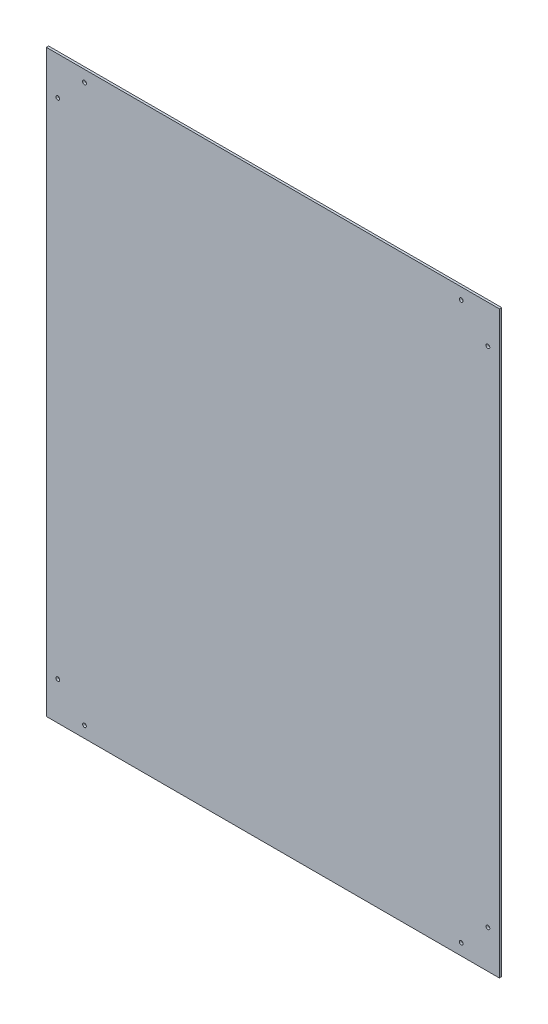
ISO-10303-21;
HEADER;
FILE_DESCRIPTION(('STEP AP214'),'2;1');
FILE_NAME('part.step','',(''),(''),'','','');
FILE_SCHEMA(('AUTOMOTIVE_DESIGN { 1 0 10303 214 1 1 1 1 }'));
ENDSEC;
DATA;
#1=APPLICATION_CONTEXT('core data for automotive mechanical design processes');
#2=APPLICATION_PROTOCOL_DEFINITION('international standard','automotive_design',2000,#1);
#3=PRODUCT_CONTEXT('',#1,'mechanical');
#4=PRODUCT('Part','Part','',(#3));
#5=PRODUCT_RELATED_PRODUCT_CATEGORY('part','',(#4));
#6=PRODUCT_DEFINITION_FORMATION('','',#4);
#7=PRODUCT_DEFINITION_CONTEXT('part definition',#1,'design');
#8=PRODUCT_DEFINITION('design','',#6,#7);
#9=PRODUCT_DEFINITION_SHAPE('','',#8);
#10=(LENGTH_UNIT() NAMED_UNIT(*) SI_UNIT(.MILLI.,.METRE.));
#11=(NAMED_UNIT(*) PLANE_ANGLE_UNIT() SI_UNIT($,.RADIAN.));
#12=(NAMED_UNIT(*) SI_UNIT($,.STERADIAN.) SOLID_ANGLE_UNIT());
#13=UNCERTAINTY_MEASURE_WITH_UNIT(LENGTH_MEASURE(1.E-05),#10,'distance_accuracy_value','');
#14=(GEOMETRIC_REPRESENTATION_CONTEXT(3) GLOBAL_UNCERTAINTY_ASSIGNED_CONTEXT((#13)) GLOBAL_UNIT_ASSIGNED_CONTEXT((#10,
#11,#12)) REPRESENTATION_CONTEXT('',''));
#15=CARTESIAN_POINT('',(0.,0.,0.));
#16=DIRECTION('',(0.,0.,1.));
#17=DIRECTION('',(1.,0.,0.));
#18=AXIS2_PLACEMENT_3D('',#15,#16,#17);
#19=CARTESIAN_POINT('',(0.,0.,3.));
#20=DIRECTION('',(1.,0.,0.));
#21=DIRECTION('',(0.,0.,-1.));
#22=AXIS2_PLACEMENT_3D('',#19,#20,#21);
#23=PLANE('',#22);
#24=DIRECTION('',(0.,-1.,0.));
#25=VECTOR('',#24,1.);
#26=CARTESIAN_POINT('',(0.,0.,0.));
#27=LINE('',#26,#25);
#28=CARTESIAN_POINT('',(0.,760.,0.));
#29=VERTEX_POINT('',#28);
#30=CARTESIAN_POINT('',(0.,0.,0.));
#31=VERTEX_POINT('',#30);
#32=EDGE_CURVE('E96',#29,#31,#27,.T.);
#33=ORIENTED_EDGE('',*,*,#32,.T.);
#34=DIRECTION('',(0.,0.,-1.));
#35=VECTOR('',#34,1.);
#36=CARTESIAN_POINT('',(0.,0.,3.));
#37=LINE('',#36,#35);
#38=CARTESIAN_POINT('',(0.,0.,3.));
#39=VERTEX_POINT('',#38);
#40=EDGE_CURVE('E11',#39,#31,#37,.T.);
#41=ORIENTED_EDGE('',*,*,#40,.F.);
#42=DIRECTION('',(0.,-1.,0.));
#43=VECTOR('',#42,1.);
#44=CARTESIAN_POINT('',(0.,0.,3.));
#45=LINE('',#44,#43);
#46=CARTESIAN_POINT('',(0.,760.,3.));
#47=VERTEX_POINT('',#46);
#48=EDGE_CURVE('E84',#47,#39,#45,.T.);
#49=ORIENTED_EDGE('',*,*,#48,.F.);
#50=DIRECTION('',(0.,0.,-1.));
#51=VECTOR('',#50,1.);
#52=CARTESIAN_POINT('',(0.,760.,3.));
#53=LINE('',#52,#51);
#54=EDGE_CURVE('E92',#47,#29,#53,.T.);
#55=ORIENTED_EDGE('',*,*,#54,.T.);
#56=EDGE_LOOP('',(#33,#41,#49,#55));
#57=FACE_BOUND('',#56,.T.);
#58=ADVANCED_FACE('F33',(#57),#23,.F.);
#59=CARTESIAN_POINT('',(0.,0.,3.));
#60=DIRECTION('',(0.,1.,0.));
#61=DIRECTION('',(0.,0.,1.));
#62=AXIS2_PLACEMENT_3D('',#59,#60,#61);
#63=PLANE('',#62);
#64=DIRECTION('',(1.,0.,0.));
#65=VECTOR('',#64,1.);
#66=CARTESIAN_POINT('',(0.,0.,0.));
#67=LINE('',#66,#65);
#68=CARTESIAN_POINT('',(594.,0.,0.));
#69=VERTEX_POINT('',#68);
#70=EDGE_CURVE('E88',#31,#69,#67,.T.);
#71=ORIENTED_EDGE('',*,*,#70,.T.);
#72=DIRECTION('',(0.,0.,-1.));
#73=VECTOR('',#72,1.);
#74=CARTESIAN_POINT('',(594.,0.,3.));
#75=LINE('',#74,#73);
#76=CARTESIAN_POINT('',(594.,0.,3.));
#77=VERTEX_POINT('',#76);
#78=EDGE_CURVE('E41',#77,#69,#75,.T.);
#79=ORIENTED_EDGE('',*,*,#78,.F.);
#80=DIRECTION('',(1.,0.,0.));
#81=VECTOR('',#80,1.);
#82=CARTESIAN_POINT('',(0.,0.,3.));
#83=LINE('',#82,#81);
#84=EDGE_CURVE('E79',#39,#77,#83,.T.);
#85=ORIENTED_EDGE('',*,*,#84,.F.);
#86=ORIENTED_EDGE('',*,*,#40,.T.);
#87=EDGE_LOOP('',(#71,#79,#85,#86));
#88=FACE_BOUND('',#87,.T.);
#89=ADVANCED_FACE('F87',(#88),#63,.F.);
#90=CARTESIAN_POINT('',(594.,0.,3.));
#91=DIRECTION('',(-1.,0.,0.));
#92=DIRECTION('',(0.,0.,1.));
#93=AXIS2_PLACEMENT_3D('',#90,#91,#92);
#94=PLANE('',#93);
#95=DIRECTION('',(0.,1.,0.));
#96=VECTOR('',#95,1.);
#97=CARTESIAN_POINT('',(594.,0.,0.));
#98=LINE('',#97,#96);
#99=CARTESIAN_POINT('',(594.,760.,0.));
#100=VERTEX_POINT('',#99);
#101=EDGE_CURVE('E66',#69,#100,#98,.T.);
#102=ORIENTED_EDGE('',*,*,#101,.T.);
#103=DIRECTION('',(0.,0.,-1.));
#104=VECTOR('',#103,1.);
#105=CARTESIAN_POINT('',(594.,760.,3.));
#106=LINE('',#105,#104);
#107=CARTESIAN_POINT('',(594.,760.,3.));
#108=VERTEX_POINT('',#107);
#109=EDGE_CURVE('E89',#108,#100,#106,.T.);
#110=ORIENTED_EDGE('',*,*,#109,.F.);
#111=DIRECTION('',(0.,1.,0.));
#112=VECTOR('',#111,1.);
#113=CARTESIAN_POINT('',(594.,0.,3.));
#114=LINE('',#113,#112);
#115=EDGE_CURVE('E82',#77,#108,#114,.T.);
#116=ORIENTED_EDGE('',*,*,#115,.F.);
#117=ORIENTED_EDGE('',*,*,#78,.T.);
#118=EDGE_LOOP('',(#102,#110,#116,#117));
#119=FACE_BOUND('',#118,.T.);
#120=ADVANCED_FACE('F90',(#119),#94,.F.);
#121=CARTESIAN_POINT('',(0.,760.,3.));
#122=DIRECTION('',(0.,-1.,0.));
#123=DIRECTION('',(0.,0.,-1.));
#124=AXIS2_PLACEMENT_3D('',#121,#122,#123);
#125=PLANE('',#124);
#126=DIRECTION('',(-1.,0.,0.));
#127=VECTOR('',#126,1.);
#128=CARTESIAN_POINT('',(0.,760.,0.));
#129=LINE('',#128,#127);
#130=EDGE_CURVE('E72',#100,#29,#129,.T.);
#131=ORIENTED_EDGE('',*,*,#130,.T.);
#132=ORIENTED_EDGE('',*,*,#54,.F.);
#133=DIRECTION('',(-1.,0.,0.));
#134=VECTOR('',#133,1.);
#135=CARTESIAN_POINT('',(0.,760.,3.));
#136=LINE('',#135,#134);
#137=EDGE_CURVE('E49',#108,#47,#136,.T.);
#138=ORIENTED_EDGE('',*,*,#137,.F.);
#139=ORIENTED_EDGE('',*,*,#109,.T.);
#140=EDGE_LOOP('',(#131,#132,#138,#139));
#141=FACE_BOUND('',#140,.T.);
#142=ADVANCED_FACE('F104',(#141),#125,.F.);
#143=CARTESIAN_POINT('',(0.,760.,3.));
#144=DIRECTION('',(0.,0.,-1.));
#145=DIRECTION('',(-1.,0.,0.));
#146=AXIS2_PLACEMENT_3D('',#143,#144,#145);
#147=PLANE('',#146);
#148=CARTESIAN_POINT('',(544.,745.,3.));
#149=DIRECTION('',(0.,0.,1.));
#150=DIRECTION('',(-1.,0.,0.));
#151=AXIS2_PLACEMENT_3D('',#148,#149,#150);
#152=CIRCLE('',#151,2.50000000000013);
#153=CARTESIAN_POINT('',(541.5,745.,3.));
#154=VERTEX_POINT('',#153);
#155=EDGE_CURVE('E152',#154,#154,#152,.T.);
#156=ORIENTED_EDGE('',*,*,#155,.F.);
#157=EDGE_LOOP('',(#156));
#158=FACE_BOUND('',#157,.T.);
#159=CARTESIAN_POINT('',(579.,710.,3.));
#160=DIRECTION('',(0.,0.,1.));
#161=DIRECTION('',(-1.,0.,0.));
#162=AXIS2_PLACEMENT_3D('',#159,#160,#161);
#163=CIRCLE('',#162,2.49999999999992);
#164=CARTESIAN_POINT('',(576.5,710.,3.));
#165=VERTEX_POINT('',#164);
#166=EDGE_CURVE('E146',#165,#165,#163,.T.);
#167=ORIENTED_EDGE('',*,*,#166,.F.);
#168=EDGE_LOOP('',(#167));
#169=FACE_BOUND('',#168,.T.);
#170=CARTESIAN_POINT('',(579.,50.0000000000001,3.));
#171=DIRECTION('',(0.,0.,1.));
#172=DIRECTION('',(-1.,0.,0.));
#173=AXIS2_PLACEMENT_3D('',#170,#171,#172);
#174=CIRCLE('',#173,2.49999999999991);
#175=CARTESIAN_POINT('',(576.5,50.0000000000001,3.));
#176=VERTEX_POINT('',#175);
#177=EDGE_CURVE('E140',#176,#176,#174,.T.);
#178=ORIENTED_EDGE('',*,*,#177,.F.);
#179=EDGE_LOOP('',(#178));
#180=FACE_BOUND('',#179,.T.);
#181=CARTESIAN_POINT('',(544.,15.0000000000001,3.));
#182=DIRECTION('',(0.,0.,1.));
#183=DIRECTION('',(-1.,0.,0.));
#184=AXIS2_PLACEMENT_3D('',#181,#182,#183);
#185=CIRCLE('',#184,2.50000000000014);
#186=CARTESIAN_POINT('',(541.5,15.0000000000001,3.));
#187=VERTEX_POINT('',#186);
#188=EDGE_CURVE('E134',#187,#187,#185,.T.);
#189=ORIENTED_EDGE('',*,*,#188,.F.);
#190=EDGE_LOOP('',(#189));
#191=FACE_BOUND('',#190,.T.);
#192=CARTESIAN_POINT('',(50.,15.,3.));
#193=DIRECTION('',(0.,0.,1.));
#194=DIRECTION('',(1.,0.,0.));
#195=AXIS2_PLACEMENT_3D('',#192,#193,#194);
#196=CIRCLE('',#195,2.5);
#197=CARTESIAN_POINT('',(52.5,15.,3.));
#198=VERTEX_POINT('',#197);
#199=EDGE_CURVE('E128',#198,#198,#196,.T.);
#200=ORIENTED_EDGE('',*,*,#199,.F.);
#201=EDGE_LOOP('',(#200));
#202=FACE_BOUND('',#201,.T.);
#203=CARTESIAN_POINT('',(15.,50.,3.));
#204=DIRECTION('',(0.,0.,1.));
#205=DIRECTION('',(1.,0.,0.));
#206=AXIS2_PLACEMENT_3D('',#203,#204,#205);
#207=CIRCLE('',#206,2.5);
#208=CARTESIAN_POINT('',(17.5,50.,3.));
#209=VERTEX_POINT('',#208);
#210=EDGE_CURVE('E122',#209,#209,#207,.T.);
#211=ORIENTED_EDGE('',*,*,#210,.F.);
#212=EDGE_LOOP('',(#211));
#213=FACE_BOUND('',#212,.T.);
#214=CARTESIAN_POINT('',(15.,710.,3.));
#215=DIRECTION('',(0.,0.,1.));
#216=DIRECTION('',(1.,0.,0.));
#217=AXIS2_PLACEMENT_3D('',#214,#215,#216);
#218=CIRCLE('',#217,2.5);
#219=CARTESIAN_POINT('',(17.5,710.,3.));
#220=VERTEX_POINT('',#219);
#221=EDGE_CURVE('E116',#220,#220,#218,.T.);
#222=ORIENTED_EDGE('',*,*,#221,.F.);
#223=EDGE_LOOP('',(#222));
#224=FACE_BOUND('',#223,.T.);
#225=CARTESIAN_POINT('',(50.,745.,3.));
#226=DIRECTION('',(0.,0.,1.));
#227=DIRECTION('',(1.,0.,0.));
#228=AXIS2_PLACEMENT_3D('',#225,#226,#227);
#229=CIRCLE('',#228,2.5);
#230=CARTESIAN_POINT('',(52.5,745.,3.));
#231=VERTEX_POINT('',#230);
#232=EDGE_CURVE('E110',#231,#231,#229,.T.);
#233=ORIENTED_EDGE('',*,*,#232,.F.);
#234=EDGE_LOOP('',(#233));
#235=FACE_BOUND('',#234,.T.);
#236=ORIENTED_EDGE('',*,*,#48,.T.);
#237=ORIENTED_EDGE('',*,*,#84,.T.);
#238=ORIENTED_EDGE('',*,*,#115,.T.);
#239=ORIENTED_EDGE('',*,*,#137,.T.);
#240=EDGE_LOOP('',(#236,#237,#238,#239));
#241=FACE_BOUND('',#240,.T.);
#242=ADVANCED_FACE('F80',(#158,#169,#180,#191,#202,#213,#224,#235,#241),#147,.F.);
#243=CARTESIAN_POINT('',(0.,760.,0.));
#244=DIRECTION('',(0.,0.,-1.));
#245=DIRECTION('',(-1.,0.,0.));
#246=AXIS2_PLACEMENT_3D('',#243,#244,#245);
#247=PLANE('',#246);
#248=CARTESIAN_POINT('',(544.,745.,0.));
#249=DIRECTION('',(0.,0.,1.));
#250=DIRECTION('',(-1.,0.,0.));
#251=AXIS2_PLACEMENT_3D('',#248,#249,#250);
#252=CIRCLE('',#251,2.50000000000013);
#253=CARTESIAN_POINT('',(541.5,745.,0.));
#254=VERTEX_POINT('',#253);
#255=EDGE_CURVE('E149',#254,#254,#252,.T.);
#256=ORIENTED_EDGE('',*,*,#255,.T.);
#257=EDGE_LOOP('',(#256));
#258=FACE_BOUND('',#257,.T.);
#259=CARTESIAN_POINT('',(579.,710.,0.));
#260=DIRECTION('',(0.,0.,1.));
#261=DIRECTION('',(-1.,0.,0.));
#262=AXIS2_PLACEMENT_3D('',#259,#260,#261);
#263=CIRCLE('',#262,2.49999999999992);
#264=CARTESIAN_POINT('',(576.5,710.,0.));
#265=VERTEX_POINT('',#264);
#266=EDGE_CURVE('E143',#265,#265,#263,.T.);
#267=ORIENTED_EDGE('',*,*,#266,.T.);
#268=EDGE_LOOP('',(#267));
#269=FACE_BOUND('',#268,.T.);
#270=CARTESIAN_POINT('',(579.,50.0000000000001,0.));
#271=DIRECTION('',(0.,0.,1.));
#272=DIRECTION('',(-1.,0.,0.));
#273=AXIS2_PLACEMENT_3D('',#270,#271,#272);
#274=CIRCLE('',#273,2.49999999999991);
#275=CARTESIAN_POINT('',(576.5,50.0000000000001,0.));
#276=VERTEX_POINT('',#275);
#277=EDGE_CURVE('E137',#276,#276,#274,.T.);
#278=ORIENTED_EDGE('',*,*,#277,.T.);
#279=EDGE_LOOP('',(#278));
#280=FACE_BOUND('',#279,.T.);
#281=CARTESIAN_POINT('',(544.,15.0000000000001,0.));
#282=DIRECTION('',(0.,0.,1.));
#283=DIRECTION('',(-1.,0.,0.));
#284=AXIS2_PLACEMENT_3D('',#281,#282,#283);
#285=CIRCLE('',#284,2.50000000000014);
#286=CARTESIAN_POINT('',(541.5,15.0000000000001,0.));
#287=VERTEX_POINT('',#286);
#288=EDGE_CURVE('E131',#287,#287,#285,.T.);
#289=ORIENTED_EDGE('',*,*,#288,.T.);
#290=EDGE_LOOP('',(#289));
#291=FACE_BOUND('',#290,.T.);
#292=CARTESIAN_POINT('',(50.,15.,0.));
#293=DIRECTION('',(0.,0.,1.));
#294=DIRECTION('',(1.,0.,0.));
#295=AXIS2_PLACEMENT_3D('',#292,#293,#294);
#296=CIRCLE('',#295,2.5);
#297=CARTESIAN_POINT('',(52.5,15.,0.));
#298=VERTEX_POINT('',#297);
#299=EDGE_CURVE('E125',#298,#298,#296,.T.);
#300=ORIENTED_EDGE('',*,*,#299,.T.);
#301=EDGE_LOOP('',(#300));
#302=FACE_BOUND('',#301,.T.);
#303=CARTESIAN_POINT('',(15.,50.,0.));
#304=DIRECTION('',(0.,0.,1.));
#305=DIRECTION('',(1.,0.,0.));
#306=AXIS2_PLACEMENT_3D('',#303,#304,#305);
#307=CIRCLE('',#306,2.5);
#308=CARTESIAN_POINT('',(17.5,50.,0.));
#309=VERTEX_POINT('',#308);
#310=EDGE_CURVE('E119',#309,#309,#307,.T.);
#311=ORIENTED_EDGE('',*,*,#310,.T.);
#312=EDGE_LOOP('',(#311));
#313=FACE_BOUND('',#312,.T.);
#314=CARTESIAN_POINT('',(15.,710.,0.));
#315=DIRECTION('',(0.,0.,1.));
#316=DIRECTION('',(1.,0.,0.));
#317=AXIS2_PLACEMENT_3D('',#314,#315,#316);
#318=CIRCLE('',#317,2.5);
#319=CARTESIAN_POINT('',(17.5,710.,0.));
#320=VERTEX_POINT('',#319);
#321=EDGE_CURVE('E113',#320,#320,#318,.T.);
#322=ORIENTED_EDGE('',*,*,#321,.T.);
#323=EDGE_LOOP('',(#322));
#324=FACE_BOUND('',#323,.T.);
#325=CARTESIAN_POINT('',(50.,745.,0.));
#326=DIRECTION('',(0.,0.,1.));
#327=DIRECTION('',(1.,0.,0.));
#328=AXIS2_PLACEMENT_3D('',#325,#326,#327);
#329=CIRCLE('',#328,2.5);
#330=CARTESIAN_POINT('',(52.5,745.,0.));
#331=VERTEX_POINT('',#330);
#332=EDGE_CURVE('E99',#331,#331,#329,.T.);
#333=ORIENTED_EDGE('',*,*,#332,.T.);
#334=EDGE_LOOP('',(#333));
#335=FACE_BOUND('',#334,.T.);
#336=ORIENTED_EDGE('',*,*,#32,.F.);
#337=ORIENTED_EDGE('',*,*,#130,.F.);
#338=ORIENTED_EDGE('',*,*,#101,.F.);
#339=ORIENTED_EDGE('',*,*,#70,.F.);
#340=EDGE_LOOP('',(#336,#337,#338,#339));
#341=FACE_BOUND('',#340,.T.);
#342=ADVANCED_FACE('F107',(#258,#269,#280,#291,#302,#313,#324,#335,#341),#247,.T.);
#343=CARTESIAN_POINT('',(50.,745.,0.));
#344=DIRECTION('',(0.,0.,1.));
#345=DIRECTION('',(1.,0.,0.));
#346=AXIS2_PLACEMENT_3D('',#343,#344,#345);
#347=CYLINDRICAL_SURFACE('',#346,2.5);
#348=ORIENTED_EDGE('',*,*,#332,.F.);
#349=EDGE_LOOP('',(#348));
#350=FACE_BOUND('',#349,.T.);
#351=ORIENTED_EDGE('',*,*,#232,.T.);
#352=EDGE_LOOP('',(#351));
#353=FACE_BOUND('',#352,.T.);
#354=ADVANCED_FACE('F184',(#350,#353),#347,.F.);
#355=CARTESIAN_POINT('',(15.,710.,0.));
#356=DIRECTION('',(0.,0.,1.));
#357=DIRECTION('',(1.,0.,0.));
#358=AXIS2_PLACEMENT_3D('',#355,#356,#357);
#359=CYLINDRICAL_SURFACE('',#358,2.5);
#360=ORIENTED_EDGE('',*,*,#321,.F.);
#361=EDGE_LOOP('',(#360));
#362=FACE_BOUND('',#361,.T.);
#363=ORIENTED_EDGE('',*,*,#221,.T.);
#364=EDGE_LOOP('',(#363));
#365=FACE_BOUND('',#364,.T.);
#366=ADVANCED_FACE('F186',(#362,#365),#359,.F.);
#367=CARTESIAN_POINT('',(15.,50.,0.));
#368=DIRECTION('',(0.,0.,1.));
#369=DIRECTION('',(1.,0.,0.));
#370=AXIS2_PLACEMENT_3D('',#367,#368,#369);
#371=CYLINDRICAL_SURFACE('',#370,2.5);
#372=ORIENTED_EDGE('',*,*,#310,.F.);
#373=EDGE_LOOP('',(#372));
#374=FACE_BOUND('',#373,.T.);
#375=ORIENTED_EDGE('',*,*,#210,.T.);
#376=EDGE_LOOP('',(#375));
#377=FACE_BOUND('',#376,.T.);
#378=ADVANCED_FACE('F193',(#374,#377),#371,.F.);
#379=CARTESIAN_POINT('',(50.,15.,0.));
#380=DIRECTION('',(0.,0.,1.));
#381=DIRECTION('',(1.,0.,0.));
#382=AXIS2_PLACEMENT_3D('',#379,#380,#381);
#383=CYLINDRICAL_SURFACE('',#382,2.5);
#384=ORIENTED_EDGE('',*,*,#299,.F.);
#385=EDGE_LOOP('',(#384));
#386=FACE_BOUND('',#385,.T.);
#387=ORIENTED_EDGE('',*,*,#199,.T.);
#388=EDGE_LOOP('',(#387));
#389=FACE_BOUND('',#388,.T.);
#390=ADVANCED_FACE('F239',(#386,#389),#383,.F.);
#391=CARTESIAN_POINT('',(544.,15.0000000000001,0.));
#392=DIRECTION('',(0.,0.,1.));
#393=DIRECTION('',(1.,0.,0.));
#394=AXIS2_PLACEMENT_3D('',#391,#392,#393);
#395=CYLINDRICAL_SURFACE('',#394,2.50000000000014);
#396=ORIENTED_EDGE('',*,*,#288,.F.);
#397=EDGE_LOOP('',(#396));
#398=FACE_BOUND('',#397,.T.);
#399=ORIENTED_EDGE('',*,*,#188,.T.);
#400=EDGE_LOOP('',(#399));
#401=FACE_BOUND('',#400,.T.);
#402=ADVANCED_FACE('F249',(#398,#401),#395,.F.);
#403=CARTESIAN_POINT('',(579.,50.0000000000001,0.));
#404=DIRECTION('',(0.,0.,1.));
#405=DIRECTION('',(1.,0.,0.));
#406=AXIS2_PLACEMENT_3D('',#403,#404,#405);
#407=CYLINDRICAL_SURFACE('',#406,2.49999999999991);
#408=ORIENTED_EDGE('',*,*,#277,.F.);
#409=EDGE_LOOP('',(#408));
#410=FACE_BOUND('',#409,.T.);
#411=ORIENTED_EDGE('',*,*,#177,.T.);
#412=EDGE_LOOP('',(#411));
#413=FACE_BOUND('',#412,.T.);
#414=ADVANCED_FACE('F259',(#410,#413),#407,.F.);
#415=CARTESIAN_POINT('',(579.,710.,0.));
#416=DIRECTION('',(0.,0.,1.));
#417=DIRECTION('',(1.,0.,0.));
#418=AXIS2_PLACEMENT_3D('',#415,#416,#417);
#419=CYLINDRICAL_SURFACE('',#418,2.49999999999992);
#420=ORIENTED_EDGE('',*,*,#266,.F.);
#421=EDGE_LOOP('',(#420));
#422=FACE_BOUND('',#421,.T.);
#423=ORIENTED_EDGE('',*,*,#166,.T.);
#424=EDGE_LOOP('',(#423));
#425=FACE_BOUND('',#424,.T.);
#426=ADVANCED_FACE('F163',(#422,#425),#419,.F.);
#427=CARTESIAN_POINT('',(544.,745.,0.));
#428=DIRECTION('',(0.,0.,1.));
#429=DIRECTION('',(1.,0.,0.));
#430=AXIS2_PLACEMENT_3D('',#427,#428,#429);
#431=CYLINDRICAL_SURFACE('',#430,2.50000000000013);
#432=ORIENTED_EDGE('',*,*,#255,.F.);
#433=EDGE_LOOP('',(#432));
#434=FACE_BOUND('',#433,.T.);
#435=ORIENTED_EDGE('',*,*,#155,.T.);
#436=EDGE_LOOP('',(#435));
#437=FACE_BOUND('',#436,.T.);
#438=ADVANCED_FACE('F160',(#434,#437),#431,.F.);
#439=CLOSED_SHELL('',(#58,#89,#120,#142,#242,#342,#354,#366,#378,#390,#402,#414,#426,#438));
#440=MANIFOLD_SOLID_BREP('B2',#439);
#441=ADVANCED_BREP_SHAPE_REPRESENTATION('',(#18,#440),#14);
#442=SHAPE_DEFINITION_REPRESENTATION(#9,#441);
ENDSEC;
END-ISO-10303-21;
